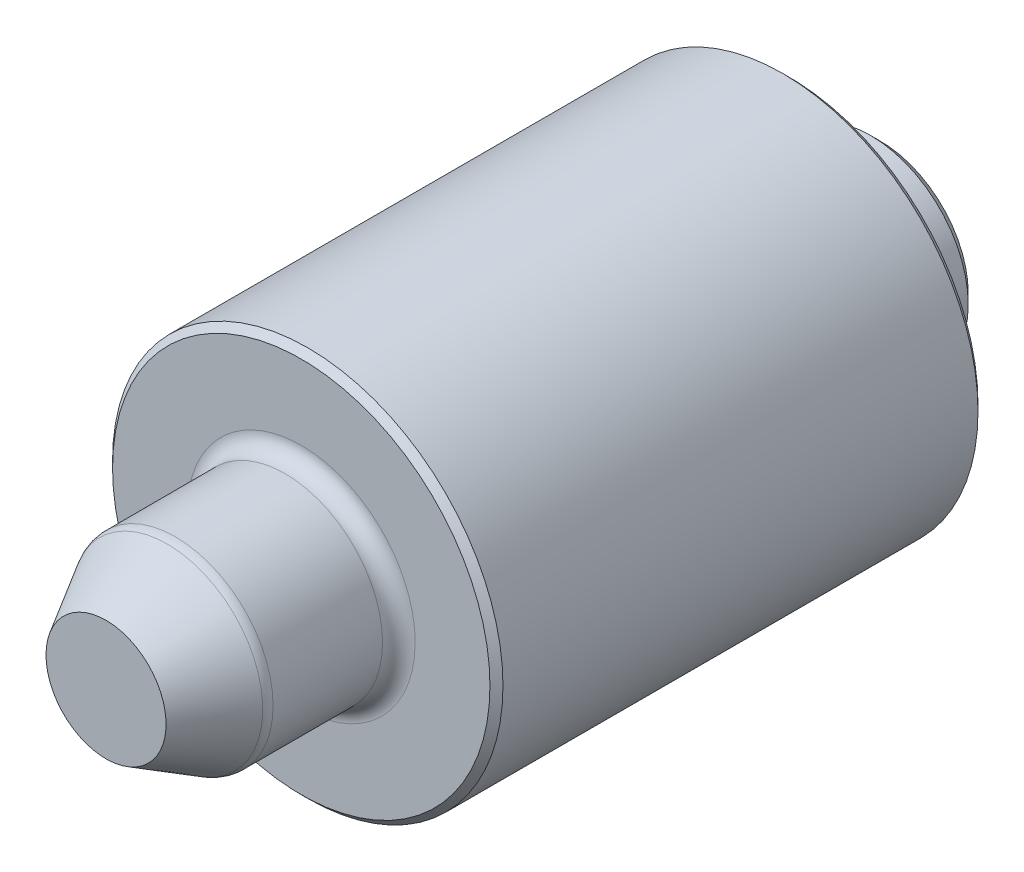
ISO-10303-21;
HEADER;
FILE_DESCRIPTION(('STEP AP214'),'2;1');
FILE_NAME('part.step','',(''),(''),'','','');
FILE_SCHEMA(('AUTOMOTIVE_DESIGN { 1 0 10303 214 1 1 1 1 }'));
ENDSEC;
DATA;
#1=APPLICATION_CONTEXT('core data for automotive mechanical design processes');
#2=APPLICATION_PROTOCOL_DEFINITION('international standard','automotive_design',2000,#1);
#3=PRODUCT_CONTEXT('',#1,'mechanical');
#4=PRODUCT('Part','Part','',(#3));
#5=PRODUCT_RELATED_PRODUCT_CATEGORY('part','',(#4));
#6=PRODUCT_DEFINITION_FORMATION('','',#4);
#7=PRODUCT_DEFINITION_CONTEXT('part definition',#1,'design');
#8=PRODUCT_DEFINITION('design','',#6,#7);
#9=PRODUCT_DEFINITION_SHAPE('','',#8);
#10=(LENGTH_UNIT() NAMED_UNIT(*) SI_UNIT(.MILLI.,.METRE.));
#11=(NAMED_UNIT(*) PLANE_ANGLE_UNIT() SI_UNIT($,.RADIAN.));
#12=(NAMED_UNIT(*) SI_UNIT($,.STERADIAN.) SOLID_ANGLE_UNIT());
#13=UNCERTAINTY_MEASURE_WITH_UNIT(LENGTH_MEASURE(1.E-05),#10,'distance_accuracy_value','');
#14=(GEOMETRIC_REPRESENTATION_CONTEXT(3) GLOBAL_UNCERTAINTY_ASSIGNED_CONTEXT((#13)) GLOBAL_UNIT_ASSIGNED_CONTEXT((#10,
#11,#12)) REPRESENTATION_CONTEXT('',''));
#15=CARTESIAN_POINT('',(0.,0.,0.));
#16=DIRECTION('',(0.,0.,1.));
#17=DIRECTION('',(1.,0.,0.));
#18=AXIS2_PLACEMENT_3D('',#15,#16,#17);
#19=CARTESIAN_POINT('',(0.,0.,21.));
#20=DIRECTION('',(0.,0.,-1.));
#21=DIRECTION('',(-1.,0.,0.));
#22=AXIS2_PLACEMENT_3D('',#19,#20,#21);
#23=PLANE('',#22);
#24=CARTESIAN_POINT('',(0.,0.,21.0000000000719));
#25=DIRECTION('',(0.,0.,-1.));
#26=DIRECTION('',(-1.,0.,0.));
#27=AXIS2_PLACEMENT_3D('',#24,#25,#26);
#28=CIRCLE('',#27,1.84529946164957);
#29=CARTESIAN_POINT('',(-1.84529946164957,0.,21.0000000000719));
#30=VERTEX_POINT('',#29);
#31=EDGE_CURVE('E51',#30,#30,#28,.T.);
#32=ORIENTED_EDGE('',*,*,#31,.F.);
#33=EDGE_LOOP('',(#32));
#34=FACE_BOUND('',#33,.T.);
#35=ADVANCED_FACE('F17',(#34),#23,.F.);
#36=CARTESIAN_POINT('',(0.,0.,5.20000000000209));
#37=DIRECTION('',(0.,0.,-1.));
#38=DIRECTION('',(-1.,0.,0.));
#39=AXIS2_PLACEMENT_3D('',#36,#37,#38);
#40=CONICAL_SURFACE('',#39,1.62100000005694,1.02974425868292);
#41=CARTESIAN_POINT('',(1.13686837721616E-10,0.,6.17399506342053));
#42=VERTEX_POINT('',#41);
#43=VERTEX_LOOP('',#42);
#44=FACE_BOUND('',#43,.T.);
#45=CARTESIAN_POINT('',(0.,0.,5.2));
#46=DIRECTION('',(0.,0.,-1.));
#47=DIRECTION('',(-1.,0.,0.));
#48=AXIS2_PLACEMENT_3D('',#45,#46,#47);
#49=CIRCLE('',#48,1.621);
#50=CARTESIAN_POINT('',(-1.621,0.,5.2));
#51=VERTEX_POINT('',#50);
#52=EDGE_CURVE('E48',#51,#51,#49,.T.);
#53=ORIENTED_EDGE('',*,*,#52,.T.);
#54=EDGE_LOOP('',(#53));
#55=FACE_BOUND('',#54,.T.);
#56=ADVANCED_FACE('F42',(#44,#55),#40,.F.);
#57=CARTESIAN_POINT('',(0.,0.,19.1160254038323));
#58=DIRECTION('',(0.,0.,-1.));
#59=DIRECTION('',(-1.,0.,0.));
#60=AXIS2_PLACEMENT_3D('',#57,#58,#59);
#61=CONICAL_SURFACE('',#60,2.93301270193069,0.523598775596622);
#62=CARTESIAN_POINT('',(0.,0.,19.116025403801));
#63=DIRECTION('',(0.,0.,1.));
#64=DIRECTION('',(-1.,0.,0.));
#65=AXIS2_PLACEMENT_3D('',#62,#63,#64);
#66=CIRCLE('',#65,2.93301270189166);
#67=CARTESIAN_POINT('',(-2.93301270189166,0.,19.116025403801));
#68=VERTEX_POINT('',#67);
#69=EDGE_CURVE('E50',#68,#68,#66,.F.);
#70=ORIENTED_EDGE('',*,*,#69,.F.);
#71=EDGE_LOOP('',(#70));
#72=FACE_BOUND('',#71,.T.);
#73=ORIENTED_EDGE('',*,*,#31,.T.);
#74=EDGE_LOOP('',(#73));
#75=FACE_BOUND('',#74,.T.);
#76=ADVANCED_FACE('F45',(#72,#75),#61,.T.);
#77=CARTESIAN_POINT('',(0.,0.,1.2));
#78=DIRECTION('',(0.,0.,-1.));
#79=DIRECTION('',(-1.,0.,0.));
#80=AXIS2_PLACEMENT_3D('',#77,#78,#79);
#81=CYLINDRICAL_SURFACE('',#80,1.621);
#82=ORIENTED_EDGE('',*,*,#52,.F.);
#83=EDGE_LOOP('',(#82));
#84=FACE_BOUND('',#83,.T.);
#85=CARTESIAN_POINT('',(0.,0.,-2.8));
#86=DIRECTION('',(0.,0.,-1.));
#87=DIRECTION('',(-1.,0.,0.));
#88=AXIS2_PLACEMENT_3D('',#85,#86,#87);
#89=CIRCLE('',#88,1.621);
#90=CARTESIAN_POINT('',(-1.621,0.,-2.8));
#91=VERTEX_POINT('',#90);
#92=EDGE_CURVE('E54',#91,#91,#89,.T.);
#93=ORIENTED_EDGE('',*,*,#92,.T.);
#94=EDGE_LOOP('',(#93));
#95=FACE_BOUND('',#94,.T.);
#96=ADVANCED_FACE('F90',(#84,#95),#81,.F.);
#97=CARTESIAN_POINT('',(0.,0.,18.8660254038));
#98=DIRECTION('',(0.,0.,1.));
#99=DIRECTION('',(-1.,0.,0.));
#100=AXIS2_PLACEMENT_3D('',#97,#98,#99);
#101=TOROIDAL_SURFACE('',#100,2.5,0.5);
#102=ORIENTED_EDGE('',*,*,#69,.T.);
#103=EDGE_LOOP('',(#102));
#104=FACE_BOUND('',#103,.T.);
#105=CARTESIAN_POINT('',(0.,0.,18.8660254031));
#106=DIRECTION('',(0.,0.,1.));
#107=DIRECTION('',(1.,0.,0.));
#108=AXIS2_PLACEMENT_3D('',#105,#106,#107);
#109=CIRCLE('',#108,3.);
#110=CARTESIAN_POINT('',(3.,0.,18.8660254031));
#111=VERTEX_POINT('',#110);
#112=EDGE_CURVE('E73',#111,#111,#109,.F.);
#113=ORIENTED_EDGE('',*,*,#112,.F.);
#114=EDGE_LOOP('',(#113));
#115=FACE_BOUND('',#114,.T.);
#116=ADVANCED_FACE('F85',(#104,#115),#101,.T.);
#117=CARTESIAN_POINT('',(0.,0.,-2.8));
#118=DIRECTION('',(0.,0.,1.));
#119=DIRECTION('',(1.,0.,0.));
#120=AXIS2_PLACEMENT_3D('',#117,#118,#119);
#121=PLANE('',#120);
#122=ORIENTED_EDGE('',*,*,#92,.F.);
#123=EDGE_LOOP('',(#122));
#124=FACE_BOUND('',#123,.T.);
#125=CARTESIAN_POINT('',(0.,0.,-2.79999999997926));
#126=DIRECTION('',(0.,0.,1.));
#127=DIRECTION('',(1.,0.,0.));
#128=AXIS2_PLACEMENT_3D('',#125,#126,#127);
#129=CIRCLE('',#128,2.70000000000437);
#130=CARTESIAN_POINT('',(2.70000000000437,0.,-2.79999999997926));
#131=VERTEX_POINT('',#130);
#132=EDGE_CURVE('E69',#131,#131,#129,.T.);
#133=ORIENTED_EDGE('',*,*,#132,.F.);
#134=EDGE_LOOP('',(#133));
#135=FACE_BOUND('',#134,.T.);
#136=ADVANCED_FACE('F89',(#124,#135),#121,.F.);
#137=CARTESIAN_POINT('',(0.,0.,15.));
#138=DIRECTION('',(0.,0.,1.));
#139=DIRECTION('',(1.,0.,0.));
#140=AXIS2_PLACEMENT_3D('',#137,#138,#139);
#141=CYLINDRICAL_SURFACE('',#140,3.);
#142=CARTESIAN_POINT('',(0.,0.,15.5));
#143=DIRECTION('',(0.,0.,-1.));
#144=DIRECTION('',(1.,0.,0.));
#145=AXIS2_PLACEMENT_3D('',#142,#143,#144);
#146=CIRCLE('',#145,3.);
#147=CARTESIAN_POINT('',(3.,0.,15.5));
#148=VERTEX_POINT('',#147);
#149=EDGE_CURVE('E72',#148,#148,#146,.F.);
#150=ORIENTED_EDGE('',*,*,#149,.T.);
#151=EDGE_LOOP('',(#150));
#152=FACE_BOUND('',#151,.T.);
#153=ORIENTED_EDGE('',*,*,#112,.T.);
#154=EDGE_LOOP('',(#153));
#155=FACE_BOUND('',#154,.T.);
#156=ADVANCED_FACE('F170',(#152,#155),#141,.T.);
#157=CARTESIAN_POINT('',(0.,0.,-2.49999999994088));
#158=DIRECTION('',(0.,0.,1.));
#159=DIRECTION('',(1.,0.,0.));
#160=AXIS2_PLACEMENT_3D('',#157,#158,#159);
#161=CONICAL_SURFACE('',#160,3.00000000004275,0.785398163397448);
#162=CARTESIAN_POINT('',(0.,0.,-2.5));
#163=DIRECTION('',(0.,0.,-1.));
#164=DIRECTION('',(-1.,0.,0.));
#165=AXIS2_PLACEMENT_3D('',#162,#163,#164);
#166=CIRCLE('',#165,3.);
#167=CARTESIAN_POINT('',(-3.,0.,-2.5));
#168=VERTEX_POINT('',#167);
#169=EDGE_CURVE('E145',#168,#168,#166,.F.);
#170=ORIENTED_EDGE('',*,*,#169,.F.);
#171=EDGE_LOOP('',(#170));
#172=FACE_BOUND('',#171,.T.);
#173=ORIENTED_EDGE('',*,*,#132,.T.);
#174=EDGE_LOOP('',(#173));
#175=FACE_BOUND('',#174,.T.);
#176=ADVANCED_FACE('F163',(#172,#175),#161,.T.);
#177=CARTESIAN_POINT('',(0.,0.,15.5));
#178=DIRECTION('',(0.,0.,-1.));
#179=DIRECTION('',(1.,0.,0.));
#180=AXIS2_PLACEMENT_3D('',#177,#178,#179);
#181=TOROIDAL_SURFACE('',#180,3.5,0.5);
#182=CARTESIAN_POINT('',(0.,0.,15.));
#183=DIRECTION('',(0.,0.,1.));
#184=DIRECTION('',(-1.,0.,0.));
#185=AXIS2_PLACEMENT_3D('',#182,#183,#184);
#186=CIRCLE('',#185,3.5);
#187=CARTESIAN_POINT('',(-3.5,0.,15.));
#188=VERTEX_POINT('',#187);
#189=CARTESIAN_POINT('',(3.5,0.,15.));
#190=VERTEX_POINT('',#189);
#191=EDGE_CURVE('E38',#188,#190,#186,.T.);
#192=ORIENTED_EDGE('',*,*,#191,.T.);
#193=CARTESIAN_POINT('',(3.5,0.,15.));
#194=CARTESIAN_POINT('',(3.4999837479241,0.0571975275624328,15.0000000013925));
#195=CARTESIAN_POINT('',(3.49857174988298,0.114394133076814,15.0000000011396));
#196=CARTESIAN_POINT('',(3.49296582079612,0.228650428071138,15.0000000001933));
#197=CARTESIAN_POINT('',(3.48877191139603,0.28571011861293,14.9999999994998));
#198=CARTESIAN_POINT('',(3.47761167315496,0.399558863136042,15.0000000005227));
#199=CARTESIAN_POINT('',(3.47064532204978,0.45634791494028,15.000000002239));
#200=CARTESIAN_POINT('',(3.45395211596631,0.569517728917855,15.0000000130731));
#201=CARTESIAN_POINT('',(3.44422519517702,0.625898481324613,15.0000000221911));
#202=CARTESIAN_POINT('',(3.41956369847254,0.750728659502737,15.0000000870769));
#203=CARTESIAN_POINT('',(3.40395025585458,0.819046097539215,15.0000001528575));
#204=CARTESIAN_POINT('',(3.37504388498403,0.929880126077705,15.0000002670168));
#205=CARTESIAN_POINT('',(3.36298028973942,0.972722454627929,15.0000003129963));
#206=CARTESIAN_POINT('',(3.33344966845933,1.07023037373436,15.0000003095688));
#207=CARTESIAN_POINT('',(3.31542908213919,1.12473080175996,15.0000002287185));
#208=CARTESIAN_POINT('',(3.27967443400608,1.22386038828058,15.0000000832188));
#209=CARTESIAN_POINT('',(3.2623745704615,1.26864755239225,15.0000000180806));
#210=CARTESIAN_POINT('',(3.23239110194865,1.34256222631512,14.9999999880399));
#211=CARTESIAN_POINT('',(3.22012572205113,1.37186166666987,14.9999999966825));
#212=CARTESIAN_POINT('',(3.17859644560614,1.46732032243547,15.0000000263824));
#213=CARTESIAN_POINT('',(3.14763298395012,1.53275404312335,15.0000000491953));
#214=CARTESIAN_POINT('',(3.09374020590658,1.63815194627954,15.0000001421627));
#215=CARTESIAN_POINT('',(3.07198459996692,1.67872404878121,15.0000001920817));
#216=CARTESIAN_POINT('',(3.03630440377297,1.74219281441045,15.0000002725259));
#217=CARTESIAN_POINT('',(3.02290868214313,1.76538731226219,15.0000003024334));
#218=CARTESIAN_POINT('',(2.98246668935909,1.83355212769595,15.0000003698552));
#219=CARTESIAN_POINT('',(2.9546516229455,1.87806959669358,15.0000003871494));
#220=CARTESIAN_POINT('',(2.89428172632266,1.96995653503681,15.0000003763766));
#221=CARTESIAN_POINT('',(2.86152767935747,2.01719486817394,15.0000003438415));
#222=CARTESIAN_POINT('',(2.79076353174081,2.11401298009889,15.0000002492543));
#223=CARTESIAN_POINT('',(2.75254396604701,2.16344031590695,15.0000001848861));
#224=CARTESIAN_POINT('',(2.69770591721901,2.23052177955234,15.0000001033873));
#225=CARTESIAN_POINT('',(2.68219676225073,2.24909210369069,15.0000000814739));
#226=CARTESIAN_POINT('',(2.64822523249683,2.28893405926013,15.0000000457931));
#227=CARTESIAN_POINT('',(2.62969597289911,2.31014874688485,15.0000000339531));
#228=CARTESIAN_POINT('',(2.57692699037199,2.36915295207233,15.0000000120685));
#229=CARTESIAN_POINT('',(2.54212470476608,2.40644183107859,15.0000000112551));
#230=CARTESIAN_POINT('',(2.46541157177912,2.48516543152388,15.0000000145917));
#231=CARTESIAN_POINT('',(2.42323695639146,2.52634300581097,15.0000000195334));
#232=CARTESIAN_POINT('',(2.33106280472232,2.61194116744524,15.000000051203));
#233=CARTESIAN_POINT('',(2.28077418863342,2.65605208745126,15.0000000807743));
#234=CARTESIAN_POINT('',(2.21344733821181,2.71180754024393,15.0000001624602));
#235=CARTESIAN_POINT('',(2.19749741364859,2.72478296826365,15.000000184786));
#236=CARTESIAN_POINT('',(2.15018340956346,2.76257958996697,15.0000002525508));
#237=CARTESIAN_POINT('',(2.11850063983622,2.78700420404654,15.000000299889));
#238=CARTESIAN_POINT('',(2.04096863106395,2.84464442899462,15.0000003838141));
#239=CARTESIAN_POINT('',(1.99470063712504,2.8772982114159,15.0000004077706));
#240=CARTESIAN_POINT('',(1.90001830557671,2.94068661929284,15.0000003987713));
#241=CARTESIAN_POINT('',(1.85158422789965,2.97139176248911,15.0000003650921));
#242=CARTESIAN_POINT('',(1.76691714809466,3.02214648806695,15.0000002713266));
#243=CARTESIAN_POINT('',(1.73103622683753,3.04278495124534,15.0000002211867));
#244=CARTESIAN_POINT('',(1.67644683037428,3.07289964925633,15.0000001532422));
#245=CARTESIAN_POINT('',(1.6580024278564,3.08285802802242,15.0000001316915));
#246=CARTESIAN_POINT('',(1.58032021594847,3.12391131782303,15.0000000553801));
#247=CARTESIAN_POINT('',(1.5202722797276,3.15349662263029,15.0000000313507));
#248=CARTESIAN_POINT('',(1.40772940042505,3.20502769363779,15.0000000078517));
#249=CARTESIAN_POINT('',(1.35545260081901,3.22745371963073,15.0000000052389));
#250=CARTESIAN_POINT('',(1.25375635975266,3.26824816514704,15.000000006029));
#251=CARTESIAN_POINT('',(1.20440793686343,3.28679344801327,15.0000000090057));
#252=CARTESIAN_POINT('',(1.10840286125321,3.32045768011426,15.0000000507988));
#253=CARTESIAN_POINT('',(1.0617982934287,3.33572534255419,15.0000000871031));
#254=CARTESIAN_POINT('',(0.960158588091746,3.36663767057319,15.0000001631609));
#255=CARTESIAN_POINT('',(0.905013042048308,3.38192099194113,15.0000002024807));
#256=CARTESIAN_POINT('',(0.794034517669303,3.40974603495608,15.0000002626278));
#257=CARTESIAN_POINT('',(0.738201523209545,3.42228769216711,15.0000002834548));
#258=CARTESIAN_POINT('',(0.625982986447731,3.44459519334299,15.0000002965699));
#259=CARTESIAN_POINT('',(0.569597443106601,3.45436103208685,15.000000288858));
#260=CARTESIAN_POINT('',(0.456413516650745,3.47108618513155,15.0000002487209));
#261=CARTESIAN_POINT('',(0.399615141706384,3.47804555482218,15.000000216296));
#262=CARTESIAN_POINT('',(0.285746634139073,3.48917024542072,15.0000001398758));
#263=CARTESIAN_POINT('',(0.228676512852166,3.49333568186832,15.0000000958809));
#264=CARTESIAN_POINT('',(0.114401488595913,3.49875091692775,15.0000000283078));
#265=CARTESIAN_POINT('',(0.0571965943410853,3.50000089914173,15.0000000047283));
#266=CARTESIAN_POINT('',(-0.028337193441438,3.49999955551906,14.9999999976574));
#267=CARTESIAN_POINT('',(-0.056672301241497,3.49969207651482,14.9999999999419));
#268=CARTESIAN_POINT('',(-0.158629044325494,3.49734221197764,15.000000018532));
#269=CARTESIAN_POINT('',(-0.232222497208803,3.49331197123925,15.0000000514153));
#270=CARTESIAN_POINT('',(-0.334859163759727,3.48445108840132,15.000000144002));
#271=CARTESIAN_POINT('',(-0.364086152276847,3.48155835715835,15.0000001756956));
#272=CARTESIAN_POINT('',(-0.435956232852079,3.47352301159393,15.0000002578629));
#273=CARTESIAN_POINT('',(-0.478553297325445,3.46795857275358,15.0000003102435));
#274=CARTESIAN_POINT('',(-0.577067852257948,3.45321060877415,15.0000004035873));
#275=CARTESIAN_POINT('',(-0.632898592546563,3.4434388318101,15.0000004355738));
#276=CARTESIAN_POINT('',(-0.718407507164575,3.4262776409881,15.0000004232816));
#277=CARTESIAN_POINT('',(-0.748285591675793,3.41986436667949,15.0000004073471));
#278=CARTESIAN_POINT('',(-0.822754067820169,3.40284760940602,15.0000003587656));
#279=CARTESIAN_POINT('',(-0.867233221394785,3.3917520285777,15.000000321746));
#280=CARTESIAN_POINT('',(-0.957740486977988,3.36728158964537,15.0000002567423));
#281=CARTESIAN_POINT('',(-1.00374670358689,3.35382584813187,15.0000002292473));
#282=CARTESIAN_POINT('',(-1.08946915530599,3.32683036215834,15.0000001811191));
#283=CARTESIAN_POINT('',(-1.12925463764722,3.31351014013335,15.0000001600578));
#284=CARTESIAN_POINT('',(-1.20269196834284,3.28744703829333,15.0000001251911));
#285=CARTESIAN_POINT('',(-1.2364105373363,3.27489201726648,15.0000001107795));
#286=CARTESIAN_POINT('',(-1.29787869875178,3.25091932465928,15.0000000867452));
#287=CARTESIAN_POINT('',(-1.32568984399613,3.23965890529952,15.0000000767246));
#288=CARTESIAN_POINT('',(-1.39215649037074,3.21174999112485,15.0000000562291));
#289=CARTESIAN_POINT('',(-1.43066884345043,3.19475782573169,15.0000000471962));
#290=CARTESIAN_POINT('',(-1.48595859612408,3.16915925411957,15.0000000335015));
#291=CARTESIAN_POINT('',(-1.50299403273113,3.16110388003056,15.0000000291806));
#292=CARTESIAN_POINT('',(-1.56413836809912,3.13163944904528,15.0000000361959));
#293=CARTESIAN_POINT('',(-1.60790408424686,3.10950889808005,15.0000000836994));
#294=CARTESIAN_POINT('',(-1.70164604116449,3.05952155716844,15.000000169794));
#295=CARTESIAN_POINT('',(-1.75144151940208,3.03132515831057,15.0000002055798));
#296=CARTESIAN_POINT('',(-1.84958659189571,2.97251971712214,15.0000002631958));
#297=CARTESIAN_POINT('',(-1.89793615229619,2.94191061836015,15.0000002850256));
#298=CARTESIAN_POINT('',(-1.99306131378831,2.87833557325427,15.0000002986255));
#299=CARTESIAN_POINT('',(-2.03983691224194,2.84536962296056,15.0000002903955));
#300=CARTESIAN_POINT('',(-2.13169589014667,2.77716206908011,15.0000002494741));
#301=CARTESIAN_POINT('',(-2.17677930349715,2.74192051111893,15.0000002167832));
#302=CARTESIAN_POINT('',(-2.26516241885514,2.66926929590373,15.0000001396673));
#303=CARTESIAN_POINT('',(-2.3084621952785,2.63185972925913,15.0000000952429));
#304=CARTESIAN_POINT('',(-2.39309510163981,2.55488344347241,15.0000000278178));
#305=CARTESIAN_POINT('',(-2.43442835625753,2.5153168614298,15.0000000048157));
#306=CARTESIAN_POINT('',(-2.49493341130866,2.45480926178447,14.9999999976228));
#307=CARTESIAN_POINT('',(-2.51477622311669,2.43453047294889,14.9999999997148));
#308=CARTESIAN_POINT('',(-2.58521893425757,2.36075990279434,15.0000000176885));
#309=CARTESIAN_POINT('',(-2.63439485250432,2.30588404028897,15.0000000502434));
#310=CARTESIAN_POINT('',(-2.7006827755541,2.22706754553217,15.0000001426945));
#311=CARTESIAN_POINT('',(-2.71929449409943,2.20436681403753,15.0000001743793));
#312=CARTESIAN_POINT('',(-2.76443374316897,2.14786395781056,15.0000002566913));
#313=CARTESIAN_POINT('',(-2.79062969137637,2.11379549067471,15.000000309289));
#314=CARTESIAN_POINT('',(-2.84986932381335,2.03369463629306,15.0000004032742));
#315=CARTESIAN_POINT('',(-2.88243628539323,1.98730806949531,15.0000004357541));
#316=CARTESIAN_POINT('',(-2.93075561183519,1.91472262584858,15.0000004240715));
#317=CARTESIAN_POINT('',(-2.94733983903018,1.88907278574578,15.0000004083333));
#318=CARTESIAN_POINT('',(-2.98809463105872,1.82417586815995,15.0000003600066));
#319=CARTESIAN_POINT('',(-3.01182955025716,1.78465376640214,15.0000003229188));
#320=CARTESIAN_POINT('',(-3.05875208870814,1.70291440812859,15.0000002577859));
#321=CARTESIAN_POINT('',(-3.08186751831808,1.66065574177781,15.0000002302205));
#322=CARTESIAN_POINT('',(-3.12354193811774,1.58058497641665,15.0000001818938));
#323=CARTESIAN_POINT('',(-3.14230860267353,1.54288083776713,15.0000001607126));
#324=CARTESIAN_POINT('',(-3.17587361205714,1.47228166688001,15.0000001256119));
#325=CARTESIAN_POINT('',(-3.19085482544642,1.43947352349216,15.0000001110864));
#326=CARTESIAN_POINT('',(-3.21736924383593,1.37894954261012,15.0000000867854));
#327=CARTESIAN_POINT('',(-3.22905940362017,1.35130223041225,15.0000000766218));
#328=CARTESIAN_POINT('',(-3.25621160360144,1.28471943379217,15.000000055938));
#329=CARTESIAN_POINT('',(-3.27133625055377,1.2456452251913,15.0000000468671));
#330=CARTESIAN_POINT('',(-3.29203285948573,1.18916841545374,15.00000003252));
#331=CARTESIAN_POINT('',(-3.29818087890662,1.17197406965197,15.0000000279895));
#332=CARTESIAN_POINT('',(-3.32038693875139,1.10845107271845,15.0000000328358));
#333=CARTESIAN_POINT('',(-3.33568657151802,1.06185288578848,15.0000000785126));
#334=CARTESIAN_POINT('',(-3.36662728838903,0.960215246764588,15.0000001605219));
#335=CARTESIAN_POINT('',(-3.38190021965963,0.905063417921912,15.0000001940278));
#336=CARTESIAN_POINT('',(-3.40971906479112,0.794076464503249,15.000000248307));
#337=CARTESIAN_POINT('',(-3.42226491606179,0.738241324275389,15.00000026908));
#338=CARTESIAN_POINT('',(-3.44457572421897,0.626017403214537,15.0000002822565));
#339=CARTESIAN_POINT('',(-3.45434067587708,0.569628621340843,15.00000027466));
#340=CARTESIAN_POINT('',(-3.4710717903538,0.456438703992178,15.0000002361812));
#341=CARTESIAN_POINT('',(-3.47803800687197,0.399637576450207,15.0000002052993));
#342=CARTESIAN_POINT('',(-3.4891525858727,0.285762534987791,15.0000001330944));
#343=CARTESIAN_POINT('',(-3.49330106178131,0.228688632140863,15.0000000917717));
#344=CARTESIAN_POINT('',(-3.49877192470042,0.114409062284995,15.0000000262028));
#345=CARTESIAN_POINT('',(-3.50009448501133,0.057203403571432,15.0000000019555));
#346=CARTESIAN_POINT('',(-3.5,0.,15.));
#347=B_SPLINE_CURVE_WITH_KNOTS('',3,(#193,#194,#195,#196,#197,#198,#199,#200,#201,#202,#203,
#204,#205,#206,#207,#208,#209,#210,#211,#212,#213,#214,#215,#216,#217,#218,#219,#220,#221,#222,
#223,#224,#225,#226,#227,#228,#229,#230,#231,#232,#233,#234,#235,#236,#237,#238,#239,#240,#241,
#242,#243,#244,#245,#246,#247,#248,#249,#250,#251,#252,#253,#254,#255,#256,#257,#258,#259,#260,
#261,#262,#263,#264,#265,#266,#267,#268,#269,#270,#271,#272,#273,#274,#275,#276,#277,#278,#279,
#280,#281,#282,#283,#284,#285,#286,#287,#288,#289,#290,#291,#292,#293,#294,#295,#296,#297,#298,
#299,#300,#301,#302,#303,#304,#305,#306,#307,#308,#309,#310,#311,#312,#313,#314,#315,#316,#317,
#318,#319,#320,#321,#322,#323,#324,#325,#326,#327,#328,#329,#330,#331,#332,#333,#334,#335,#336,
#337,#338,#339,#340,#341,#342,#343,#344,#345,#346),.UNSPECIFIED.,.F.,.F.,(4,2,2,2,2,2,2,2,2,2,2,
2,2,2,2,2,2,2,2,2,2,2,2,2,2,2,2,2,2,2,2,2,2,2,2,2,2,2,2,2,2,2,2,2,2,2,2,2,2,2,2,2,2,2,2,2,2,2,2,
2,2,2,2,2,2,2,2,2,2,2,2,2,2,2,2,2,4),(0.,0.171574684161794,0.343148033340918,0.514722760375071,
0.686301578033679,0.896397261008224,1.02989557449886,1.20201459372004,1.34601321647368,
1.44129731301797,1.65829928891464,1.79637833664187,1.87672692360398,2.03414508851547,
2.20652656980832,2.39386415730227,2.46644497638275,2.55093954961599,2.70390934894713,
2.88066946711497,3.08122501753956,3.14290698566378,3.26289517768789,3.43271567997077,
3.60468314858029,3.72883431460555,3.79171582859029,3.99241192120821,4.16300333362565,
4.32110512345133,4.46818864597223,4.63978847139423,4.81139232940856,4.98299651018779,
5.15459730394055,5.32619100091456,5.49777389140059,5.58278176920204,5.80370619295775,
5.89181032328809,6.02065704930806,6.19061746553514,6.28228511651345,6.41977371787083,
6.56353397731859,6.68937530495657,6.79729807754933,6.8873026055573,7.01355283024158,
7.07008384950443,7.21716740091568,7.38876725849062,7.56037113086279,7.73197529083156,
7.90357601123361,8.07516956494599,8.24675222489018,8.3318655521265,8.55273705923571,
8.64079698485432,8.76969308342635,8.93964718256339,9.03127169741536,9.16953736080528,
9.31399906688733,9.44032098431247,9.54850347321794,9.63854683248485,9.76421211091683,
9.81899268036028,9.96608450256483,10.1376938413748,10.3093071184386,10.4809207181521,
10.6525310249447,10.824134423282,10.9957272976695),.UNSPECIFIED.);
#348=EDGE_CURVE('E36',#190,#188,#347,.T.);
#349=ORIENTED_EDGE('',*,*,#348,.T.);
#350=EDGE_LOOP('',(#192,#349));
#351=FACE_BOUND('',#350,.T.);
#352=ORIENTED_EDGE('',*,*,#149,.F.);
#353=EDGE_LOOP('',(#352));
#354=FACE_BOUND('',#353,.T.);
#355=ADVANCED_FACE('F154',(#351,#354),#181,.F.);
#356=CARTESIAN_POINT('',(0.,0.,0.));
#357=DIRECTION('',(0.,0.,-1.));
#358=DIRECTION('',(-1.,0.,0.));
#359=AXIS2_PLACEMENT_3D('',#356,#357,#358);
#360=CYLINDRICAL_SURFACE('',#359,3.);
#361=ORIENTED_EDGE('',*,*,#169,.T.);
#362=EDGE_LOOP('',(#361));
#363=FACE_BOUND('',#362,.T.);
#364=CARTESIAN_POINT('',(0.,0.,0.));
#365=DIRECTION('',(0.,0.,-1.));
#366=DIRECTION('',(-1.,0.,0.));
#367=AXIS2_PLACEMENT_3D('',#364,#365,#366);
#368=CIRCLE('',#367,3.);
#369=CARTESIAN_POINT('',(-3.,0.,0.));
#370=VERTEX_POINT('',#369);
#371=EDGE_CURVE('E66',#370,#370,#368,.F.);
#372=ORIENTED_EDGE('',*,*,#371,.F.);
#373=EDGE_LOOP('',(#372));
#374=FACE_BOUND('',#373,.T.);
#375=ADVANCED_FACE('F127',(#363,#374),#360,.T.);
#376=CARTESIAN_POINT('',(0.,0.,15.));
#377=DIRECTION('',(0.,0.,-1.));
#378=DIRECTION('',(-1.,0.,0.));
#379=AXIS2_PLACEMENT_3D('',#376,#377,#378);
#380=PLANE('',#379);
#381=ORIENTED_EDGE('',*,*,#348,.F.);
#382=ORIENTED_EDGE('',*,*,#191,.F.);
#383=EDGE_LOOP('',(#381,#382));
#384=FACE_BOUND('',#383,.T.);
#385=CARTESIAN_POINT('',(0.,0.,15.0000000000432));
#386=DIRECTION('',(0.,0.,-1.));
#387=DIRECTION('',(-1.,0.,0.));
#388=AXIS2_PLACEMENT_3D('',#385,#386,#387);
#389=CIRCLE('',#388,5.80000000002201);
#390=CARTESIAN_POINT('',(-5.80000000002201,0.,15.0000000000432));
#391=VERTEX_POINT('',#390);
#392=EDGE_CURVE('E63',#391,#391,#389,.T.);
#393=ORIENTED_EDGE('',*,*,#392,.F.);
#394=EDGE_LOOP('',(#393));
#395=FACE_BOUND('',#394,.T.);
#396=ADVANCED_FACE('F122',(#384,#395),#380,.F.);
#397=CARTESIAN_POINT('',(0.,0.,0.));
#398=DIRECTION('',(0.,0.,-1.));
#399=DIRECTION('',(-1.,0.,0.));
#400=AXIS2_PLACEMENT_3D('',#397,#398,#399);
#401=PLANE('',#400);
#402=ORIENTED_EDGE('',*,*,#371,.T.);
#403=EDGE_LOOP('',(#402));
#404=FACE_BOUND('',#403,.T.);
#405=CARTESIAN_POINT('',(0.,0.,-5.6843418860808E-11));
#406=DIRECTION('',(0.,0.,1.));
#407=DIRECTION('',(1.,0.,0.));
#408=AXIS2_PLACEMENT_3D('',#405,#406,#407);
#409=CIRCLE('',#408,5.80000000002201);
#410=CARTESIAN_POINT('',(5.80000000002201,0.,-5.6843418860808E-11));
#411=VERTEX_POINT('',#410);
#412=EDGE_CURVE('E60',#411,#411,#409,.T.);
#413=ORIENTED_EDGE('',*,*,#412,.F.);
#414=EDGE_LOOP('',(#413));
#415=FACE_BOUND('',#414,.T.);
#416=ADVANCED_FACE('F118',(#404,#415),#401,.T.);
#417=CARTESIAN_POINT('',(0.,0.,14.7999999999797));
#418=DIRECTION('',(0.,0.,-1.));
#419=DIRECTION('',(-1.,0.,0.));
#420=AXIS2_PLACEMENT_3D('',#417,#418,#419);
#421=CONICAL_SURFACE('',#420,6.00000000002865,0.78539816325534);
#422=CARTESIAN_POINT('',(0.,0.,14.8));
#423=DIRECTION('',(0.,0.,1.));
#424=DIRECTION('',(1.,0.,0.));
#425=AXIS2_PLACEMENT_3D('',#422,#423,#424);
#426=CIRCLE('',#425,6.);
#427=CARTESIAN_POINT('',(6.,0.,14.8));
#428=VERTEX_POINT('',#427);
#429=EDGE_CURVE('E28',#428,#428,#426,.F.);
#430=ORIENTED_EDGE('',*,*,#429,.F.);
#431=EDGE_LOOP('',(#430));
#432=FACE_BOUND('',#431,.T.);
#433=ORIENTED_EDGE('',*,*,#392,.T.);
#434=EDGE_LOOP('',(#433));
#435=FACE_BOUND('',#434,.T.);
#436=ADVANCED_FACE('F110',(#432,#435),#421,.T.);
#437=CARTESIAN_POINT('',(0.,0.,0.199999999495049));
#438=DIRECTION('',(0.,0.,1.));
#439=DIRECTION('',(1.,0.,0.));
#440=AXIS2_PLACEMENT_3D('',#437,#438,#439);
#441=CONICAL_SURFACE('',#440,5.9999999995739,0.785398163397448);
#442=ORIENTED_EDGE('',*,*,#412,.T.);
#443=EDGE_LOOP('',(#442));
#444=FACE_BOUND('',#443,.T.);
#445=CARTESIAN_POINT('',(0.,0.,0.199999999255));
#446=DIRECTION('',(0.,0.,1.));
#447=DIRECTION('',(1.,0.,0.));
#448=AXIS2_PLACEMENT_3D('',#445,#446,#447);
#449=CIRCLE('',#448,6.);
#450=CARTESIAN_POINT('',(6.,0.,0.199999999255));
#451=VERTEX_POINT('',#450);
#452=EDGE_CURVE('E11',#451,#451,#449,.T.);
#453=ORIENTED_EDGE('',*,*,#452,.F.);
#454=EDGE_LOOP('',(#453));
#455=FACE_BOUND('',#454,.T.);
#456=ADVANCED_FACE('F104',(#444,#455),#441,.T.);
#457=CARTESIAN_POINT('',(0.,0.,0.));
#458=DIRECTION('',(0.,0.,1.));
#459=DIRECTION('',(1.,0.,0.));
#460=AXIS2_PLACEMENT_3D('',#457,#458,#459);
#461=CYLINDRICAL_SURFACE('',#460,6.);
#462=ORIENTED_EDGE('',*,*,#429,.T.);
#463=EDGE_LOOP('',(#462));
#464=FACE_BOUND('',#463,.T.);
#465=ORIENTED_EDGE('',*,*,#452,.T.);
#466=EDGE_LOOP('',(#465));
#467=FACE_BOUND('',#466,.T.);
#468=ADVANCED_FACE('F102',(#464,#467),#461,.T.);
#469=CLOSED_SHELL('',(#35,#56,#76,#96,#116,#136,#156,#176,#355,#375,#396,#416,#436,#456,#468));
#470=MANIFOLD_SOLID_BREP('B1',#469);
#471=ADVANCED_BREP_SHAPE_REPRESENTATION('',(#18,#470),#14);
#472=SHAPE_DEFINITION_REPRESENTATION(#9,#471);
ENDSEC;
END-ISO-10303-21;
